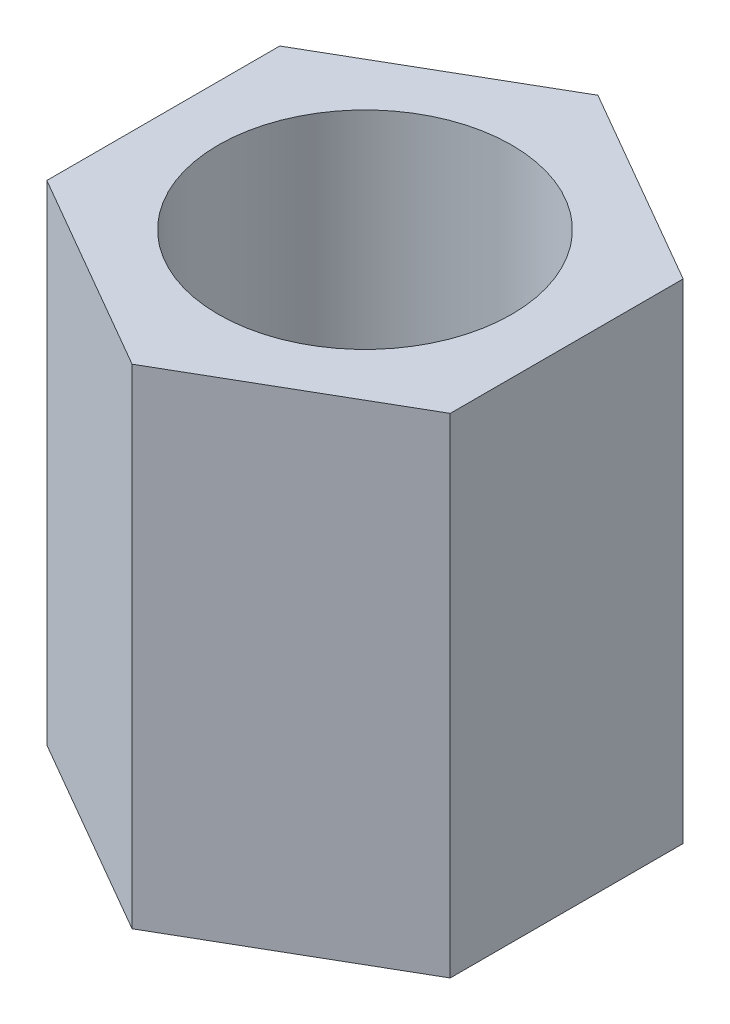
ISO-10303-21;
HEADER;
FILE_DESCRIPTION(('STEP AP214'),'2;1');
FILE_NAME('part.step','',(''),(''),'','','');
FILE_SCHEMA(('AUTOMOTIVE_DESIGN { 1 0 10303 214 1 1 1 1 }'));
ENDSEC;
DATA;
#1=APPLICATION_CONTEXT('core data for automotive mechanical design processes');
#2=APPLICATION_PROTOCOL_DEFINITION('international standard','automotive_design',2000,#1);
#3=PRODUCT_CONTEXT('',#1,'mechanical');
#4=PRODUCT('Part','Part','',(#3));
#5=PRODUCT_RELATED_PRODUCT_CATEGORY('part','',(#4));
#6=PRODUCT_DEFINITION_FORMATION('','',#4);
#7=PRODUCT_DEFINITION_CONTEXT('part definition',#1,'design');
#8=PRODUCT_DEFINITION('design','',#6,#7);
#9=PRODUCT_DEFINITION_SHAPE('','',#8);
#10=(LENGTH_UNIT() NAMED_UNIT(*) SI_UNIT(.MILLI.,.METRE.));
#11=(NAMED_UNIT(*) PLANE_ANGLE_UNIT() SI_UNIT($,.RADIAN.));
#12=(NAMED_UNIT(*) SI_UNIT($,.STERADIAN.) SOLID_ANGLE_UNIT());
#13=UNCERTAINTY_MEASURE_WITH_UNIT(LENGTH_MEASURE(1.E-05),#10,'distance_accuracy_value','');
#14=(GEOMETRIC_REPRESENTATION_CONTEXT(3) GLOBAL_UNCERTAINTY_ASSIGNED_CONTEXT((#13)) GLOBAL_UNIT_ASSIGNED_CONTEXT((#10,
#11,#12)) REPRESENTATION_CONTEXT('',''));
#15=CARTESIAN_POINT('',(0.,0.,0.));
#16=DIRECTION('',(0.,0.,1.));
#17=DIRECTION('',(1.,0.,0.));
#18=AXIS2_PLACEMENT_3D('',#15,#16,#17);
#19=CARTESIAN_POINT('',(0.,10.,0.));
#20=DIRECTION('',(0.,1.,0.));
#21=DIRECTION('',(0.,0.,1.));
#22=AXIS2_PLACEMENT_3D('',#19,#20,#21);
#23=PLANE('',#22);
#24=DIRECTION('',(-0.866025403784439,0.,-0.5));
#25=VECTOR('',#24,1.);
#26=CARTESIAN_POINT('',(4.125,10.,-2.38156986040721));
#27=LINE('',#26,#25);
#28=CARTESIAN_POINT('',(4.125,10.,-2.38156986040721));
#29=VERTEX_POINT('',#28);
#30=CARTESIAN_POINT('',(0.,10.,-4.76313972081441));
#31=VERTEX_POINT('',#30);
#32=EDGE_CURVE('E128',#29,#31,#27,.T.);
#33=ORIENTED_EDGE('',*,*,#32,.T.);
#34=DIRECTION('',(-0.866025403784439,0.,0.5));
#35=VECTOR('',#34,1.);
#36=CARTESIAN_POINT('',(0.,10.,-4.76313972081441));
#37=LINE('',#36,#35);
#38=CARTESIAN_POINT('',(-4.125,10.,-2.38156986040721));
#39=VERTEX_POINT('',#38);
#40=EDGE_CURVE('E86',#31,#39,#37,.T.);
#41=ORIENTED_EDGE('',*,*,#40,.T.);
#42=DIRECTION('',(0.,0.,1.));
#43=VECTOR('',#42,1.);
#44=CARTESIAN_POINT('',(-4.125,10.,-2.38156986040721));
#45=LINE('',#44,#43);
#46=CARTESIAN_POINT('',(-4.125,10.,2.38156986040721));
#47=VERTEX_POINT('',#46);
#48=EDGE_CURVE('E99',#39,#47,#45,.T.);
#49=ORIENTED_EDGE('',*,*,#48,.T.);
#50=DIRECTION('',(0.866025403784439,0.,0.5));
#51=VECTOR('',#50,1.);
#52=CARTESIAN_POINT('',(-4.125,10.,2.38156986040721));
#53=LINE('',#52,#51);
#54=CARTESIAN_POINT('',(0.,10.,4.76313972081441));
#55=VERTEX_POINT('',#54);
#56=EDGE_CURVE('E93',#47,#55,#53,.T.);
#57=ORIENTED_EDGE('',*,*,#56,.T.);
#58=DIRECTION('',(0.866025403784439,0.,-0.5));
#59=VECTOR('',#58,1.);
#60=CARTESIAN_POINT('',(0.,10.,4.76313972081441));
#61=LINE('',#60,#59);
#62=CARTESIAN_POINT('',(4.125,10.,2.38156986040721));
#63=VERTEX_POINT('',#62);
#64=EDGE_CURVE('E97',#55,#63,#61,.T.);
#65=ORIENTED_EDGE('',*,*,#64,.T.);
#66=DIRECTION('',(0.,0.,-1.));
#67=VECTOR('',#66,1.);
#68=CARTESIAN_POINT('',(4.125,10.,2.38156986040721));
#69=LINE('',#68,#67);
#70=EDGE_CURVE('E49',#63,#29,#69,.T.);
#71=ORIENTED_EDGE('',*,*,#70,.T.);
#72=EDGE_LOOP('',(#33,#41,#49,#57,#65,#71));
#73=FACE_BOUND('',#72,.T.);
#74=CARTESIAN_POINT('',(0.,10.,0.));
#75=DIRECTION('',(0.,1.,0.));
#76=DIRECTION('',(0.,0.,1.));
#77=AXIS2_PLACEMENT_3D('',#74,#75,#76);
#78=CIRCLE('',#77,3.);
#79=CARTESIAN_POINT('',(0.,10.,3.));
#80=VERTEX_POINT('',#79);
#81=EDGE_CURVE('E121',#80,#80,#78,.T.);
#82=ORIENTED_EDGE('',*,*,#81,.F.);
#83=EDGE_LOOP('',(#82));
#84=FACE_BOUND('',#83,.T.);
#85=ADVANCED_FACE('F32',(#73,#84),#23,.T.);
#86=CARTESIAN_POINT('',(0.,0.,0.));
#87=DIRECTION('',(0.,1.,0.));
#88=DIRECTION('',(0.,0.,1.));
#89=AXIS2_PLACEMENT_3D('',#86,#87,#88);
#90=PLANE('',#89);
#91=DIRECTION('',(-0.866025403784439,0.,-0.5));
#92=VECTOR('',#91,1.);
#93=CARTESIAN_POINT('',(4.125,0.,-2.38156986040721));
#94=LINE('',#93,#92);
#95=CARTESIAN_POINT('',(4.125,0.,-2.38156986040721));
#96=VERTEX_POINT('',#95);
#97=CARTESIAN_POINT('',(0.,0.,-4.76313972081441));
#98=VERTEX_POINT('',#97);
#99=EDGE_CURVE('E117',#96,#98,#94,.T.);
#100=ORIENTED_EDGE('',*,*,#99,.F.);
#101=DIRECTION('',(0.,0.,-1.));
#102=VECTOR('',#101,1.);
#103=CARTESIAN_POINT('',(4.125,0.,2.38156986040721));
#104=LINE('',#103,#102);
#105=CARTESIAN_POINT('',(4.125,0.,2.38156986040721));
#106=VERTEX_POINT('',#105);
#107=EDGE_CURVE('E78',#106,#96,#104,.T.);
#108=ORIENTED_EDGE('',*,*,#107,.F.);
#109=DIRECTION('',(0.866025403784439,0.,-0.5));
#110=VECTOR('',#109,1.);
#111=CARTESIAN_POINT('',(0.,0.,4.76313972081441));
#112=LINE('',#111,#110);
#113=CARTESIAN_POINT('',(0.,0.,4.76313972081441));
#114=VERTEX_POINT('',#113);
#115=EDGE_CURVE('E72',#114,#106,#112,.T.);
#116=ORIENTED_EDGE('',*,*,#115,.F.);
#117=DIRECTION('',(0.866025403784439,0.,0.5));
#118=VECTOR('',#117,1.);
#119=CARTESIAN_POINT('',(-4.125,0.,2.38156986040721));
#120=LINE('',#119,#118);
#121=CARTESIAN_POINT('',(-4.125,0.,2.38156986040721));
#122=VERTEX_POINT('',#121);
#123=EDGE_CURVE('E107',#122,#114,#120,.T.);
#124=ORIENTED_EDGE('',*,*,#123,.F.);
#125=DIRECTION('',(0.,0.,1.));
#126=VECTOR('',#125,1.);
#127=CARTESIAN_POINT('',(-4.125,0.,-2.38156986040721));
#128=LINE('',#127,#126);
#129=CARTESIAN_POINT('',(-4.125,0.,-2.38156986040721));
#130=VERTEX_POINT('',#129);
#131=EDGE_CURVE('E123',#130,#122,#128,.T.);
#132=ORIENTED_EDGE('',*,*,#131,.F.);
#133=DIRECTION('',(-0.866025403784439,0.,0.5));
#134=VECTOR('',#133,1.);
#135=CARTESIAN_POINT('',(0.,0.,-4.76313972081441));
#136=LINE('',#135,#134);
#137=EDGE_CURVE('E120',#98,#130,#136,.T.);
#138=ORIENTED_EDGE('',*,*,#137,.F.);
#139=EDGE_LOOP('',(#100,#108,#116,#124,#132,#138));
#140=FACE_BOUND('',#139,.T.);
#141=CARTESIAN_POINT('',(0.,0.,0.));
#142=DIRECTION('',(0.,1.,0.));
#143=DIRECTION('',(0.,0.,1.));
#144=AXIS2_PLACEMENT_3D('',#141,#142,#143);
#145=CIRCLE('',#144,3.);
#146=CARTESIAN_POINT('',(0.,0.,3.));
#147=VERTEX_POINT('',#146);
#148=EDGE_CURVE('E221',#147,#147,#145,.T.);
#149=ORIENTED_EDGE('',*,*,#148,.T.);
#150=EDGE_LOOP('',(#149));
#151=FACE_BOUND('',#150,.T.);
#152=ADVANCED_FACE('F137',(#140,#151),#90,.F.);
#153=CARTESIAN_POINT('',(4.125,10.,-2.38156986040721));
#154=DIRECTION('',(-0.5,0.,0.866025403784439));
#155=DIRECTION('',(0.866025403784439,0.,0.5));
#156=AXIS2_PLACEMENT_3D('',#153,#154,#155);
#157=PLANE('',#156);
#158=ORIENTED_EDGE('',*,*,#99,.T.);
#159=DIRECTION('',(0.,-1.,0.));
#160=VECTOR('',#159,1.);
#161=CARTESIAN_POINT('',(0.,10.,-4.76313972081441));
#162=LINE('',#161,#160);
#163=EDGE_CURVE('E11',#31,#98,#162,.T.);
#164=ORIENTED_EDGE('',*,*,#163,.F.);
#165=ORIENTED_EDGE('',*,*,#32,.F.);
#166=DIRECTION('',(0.,-1.,0.));
#167=VECTOR('',#166,1.);
#168=CARTESIAN_POINT('',(4.125,10.,-2.38156986040721));
#169=LINE('',#168,#167);
#170=EDGE_CURVE('E113',#29,#96,#169,.T.);
#171=ORIENTED_EDGE('',*,*,#170,.T.);
#172=EDGE_LOOP('',(#158,#164,#165,#171));
#173=FACE_BOUND('',#172,.T.);
#174=ADVANCED_FACE('F34',(#173),#157,.F.);
#175=CARTESIAN_POINT('',(0.,10.,-4.76313972081441));
#176=DIRECTION('',(0.5,0.,0.866025403784439));
#177=DIRECTION('',(0.866025403784439,0.,-0.5));
#178=AXIS2_PLACEMENT_3D('',#175,#176,#177);
#179=PLANE('',#178);
#180=ORIENTED_EDGE('',*,*,#137,.T.);
#181=DIRECTION('',(0.,-1.,0.));
#182=VECTOR('',#181,1.);
#183=CARTESIAN_POINT('',(-4.125,10.,-2.38156986040721));
#184=LINE('',#183,#182);
#185=EDGE_CURVE('E41',#39,#130,#184,.T.);
#186=ORIENTED_EDGE('',*,*,#185,.F.);
#187=ORIENTED_EDGE('',*,*,#40,.F.);
#188=ORIENTED_EDGE('',*,*,#163,.T.);
#189=EDGE_LOOP('',(#180,#186,#187,#188));
#190=FACE_BOUND('',#189,.T.);
#191=ADVANCED_FACE('F162',(#190),#179,.F.);
#192=CARTESIAN_POINT('',(-4.125,10.,-2.38156986040721));
#193=DIRECTION('',(1.,0.,0.));
#194=DIRECTION('',(0.,0.,-1.));
#195=AXIS2_PLACEMENT_3D('',#192,#193,#194);
#196=PLANE('',#195);
#197=ORIENTED_EDGE('',*,*,#131,.T.);
#198=DIRECTION('',(0.,-1.,0.));
#199=VECTOR('',#198,1.);
#200=CARTESIAN_POINT('',(-4.125,10.,2.38156986040721));
#201=LINE('',#200,#199);
#202=EDGE_CURVE('E108',#47,#122,#201,.T.);
#203=ORIENTED_EDGE('',*,*,#202,.F.);
#204=ORIENTED_EDGE('',*,*,#48,.F.);
#205=ORIENTED_EDGE('',*,*,#185,.T.);
#206=EDGE_LOOP('',(#197,#203,#204,#205));
#207=FACE_BOUND('',#206,.T.);
#208=ADVANCED_FACE('F134',(#207),#196,.F.);
#209=CARTESIAN_POINT('',(-4.125,10.,2.38156986040721));
#210=DIRECTION('',(0.5,0.,-0.866025403784439));
#211=DIRECTION('',(-0.866025403784439,0.,-0.5));
#212=AXIS2_PLACEMENT_3D('',#209,#210,#211);
#213=PLANE('',#212);
#214=ORIENTED_EDGE('',*,*,#123,.T.);
#215=DIRECTION('',(0.,-1.,0.));
#216=VECTOR('',#215,1.);
#217=CARTESIAN_POINT('',(0.,10.,4.76313972081441));
#218=LINE('',#217,#216);
#219=EDGE_CURVE('E104',#55,#114,#218,.T.);
#220=ORIENTED_EDGE('',*,*,#219,.F.);
#221=ORIENTED_EDGE('',*,*,#56,.F.);
#222=ORIENTED_EDGE('',*,*,#202,.T.);
#223=EDGE_LOOP('',(#214,#220,#221,#222));
#224=FACE_BOUND('',#223,.T.);
#225=ADVANCED_FACE('F105',(#224),#213,.F.);
#226=CARTESIAN_POINT('',(0.,10.,4.76313972081441));
#227=DIRECTION('',(-0.5,0.,-0.866025403784439));
#228=DIRECTION('',(-0.866025403784439,0.,0.5));
#229=AXIS2_PLACEMENT_3D('',#226,#227,#228);
#230=PLANE('',#229);
#231=ORIENTED_EDGE('',*,*,#115,.T.);
#232=DIRECTION('',(0.,-1.,0.));
#233=VECTOR('',#232,1.);
#234=CARTESIAN_POINT('',(4.125,10.,2.38156986040721));
#235=LINE('',#234,#233);
#236=EDGE_CURVE('E109',#63,#106,#235,.T.);
#237=ORIENTED_EDGE('',*,*,#236,.F.);
#238=ORIENTED_EDGE('',*,*,#64,.F.);
#239=ORIENTED_EDGE('',*,*,#219,.T.);
#240=EDGE_LOOP('',(#231,#237,#238,#239));
#241=FACE_BOUND('',#240,.T.);
#242=ADVANCED_FACE('F111',(#241),#230,.F.);
#243=CARTESIAN_POINT('',(4.125,10.,2.38156986040721));
#244=DIRECTION('',(-1.,0.,0.));
#245=DIRECTION('',(0.,0.,1.));
#246=AXIS2_PLACEMENT_3D('',#243,#244,#245);
#247=PLANE('',#246);
#248=ORIENTED_EDGE('',*,*,#107,.T.);
#249=ORIENTED_EDGE('',*,*,#170,.F.);
#250=ORIENTED_EDGE('',*,*,#70,.F.);
#251=ORIENTED_EDGE('',*,*,#236,.T.);
#252=EDGE_LOOP('',(#248,#249,#250,#251));
#253=FACE_BOUND('',#252,.T.);
#254=ADVANCED_FACE('F142',(#253),#247,.F.);
#255=CARTESIAN_POINT('',(0.,10.,0.));
#256=DIRECTION('',(0.,-1.,0.));
#257=DIRECTION('',(0.,0.,-1.));
#258=AXIS2_PLACEMENT_3D('',#255,#256,#257);
#259=CYLINDRICAL_SURFACE('',#258,3.);
#260=ORIENTED_EDGE('',*,*,#81,.T.);
#261=EDGE_LOOP('',(#260));
#262=FACE_BOUND('',#261,.T.);
#263=ORIENTED_EDGE('',*,*,#148,.F.);
#264=EDGE_LOOP('',(#263));
#265=FACE_BOUND('',#264,.T.);
#266=ADVANCED_FACE('F144',(#262,#265),#259,.F.);
#267=CLOSED_SHELL('',(#85,#152,#174,#191,#208,#225,#242,#254,#266));
#268=MANIFOLD_SOLID_BREP('B2',#267);
#269=ADVANCED_BREP_SHAPE_REPRESENTATION('',(#18,#268),#14);
#270=SHAPE_DEFINITION_REPRESENTATION(#9,#269);
ENDSEC;
END-ISO-10303-21;
